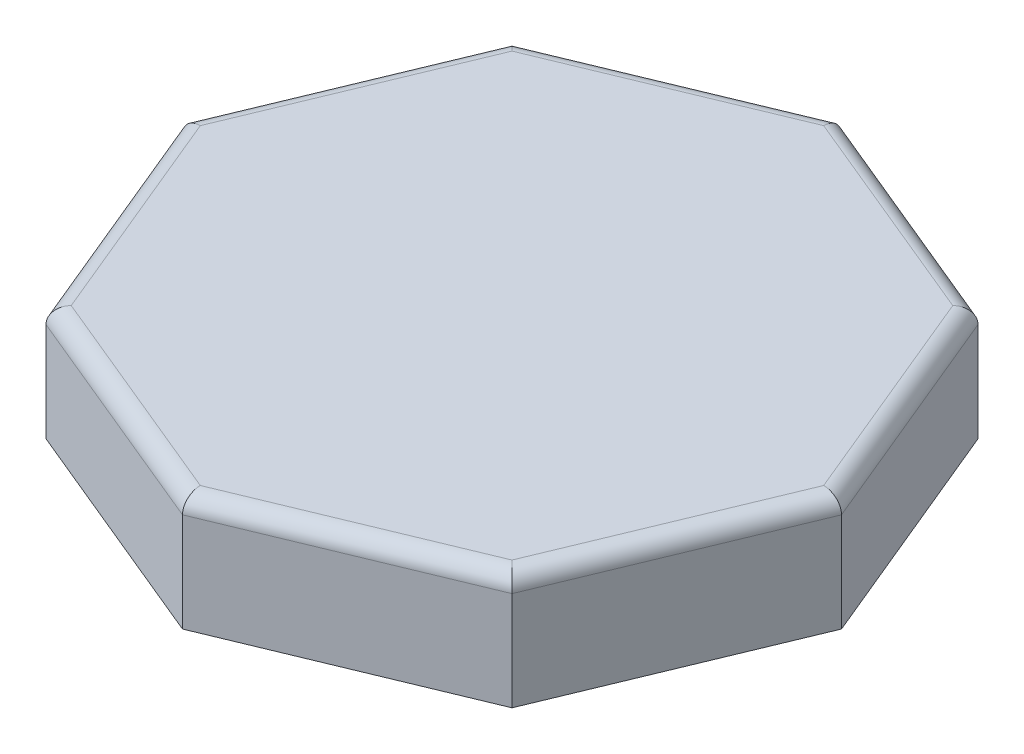
ISO-10303-21;
HEADER;
FILE_DESCRIPTION(('STEP AP214'),'2;1');
FILE_NAME('part.step','',(''),(''),'','','');
FILE_SCHEMA(('AUTOMOTIVE_DESIGN { 1 0 10303 214 1 1 1 1 }'));
ENDSEC;
DATA;
#1=APPLICATION_CONTEXT('core data for automotive mechanical design processes');
#2=APPLICATION_PROTOCOL_DEFINITION('international standard','automotive_design',2000,#1);
#3=PRODUCT_CONTEXT('',#1,'mechanical');
#4=PRODUCT('Part','Part','',(#3));
#5=PRODUCT_RELATED_PRODUCT_CATEGORY('part','',(#4));
#6=PRODUCT_DEFINITION_FORMATION('','',#4);
#7=PRODUCT_DEFINITION_CONTEXT('part definition',#1,'design');
#8=PRODUCT_DEFINITION('design','',#6,#7);
#9=PRODUCT_DEFINITION_SHAPE('','',#8);
#10=(LENGTH_UNIT() NAMED_UNIT(*) SI_UNIT(.MILLI.,.METRE.));
#11=(NAMED_UNIT(*) PLANE_ANGLE_UNIT() SI_UNIT($,.RADIAN.));
#12=(NAMED_UNIT(*) SI_UNIT($,.STERADIAN.) SOLID_ANGLE_UNIT());
#13=UNCERTAINTY_MEASURE_WITH_UNIT(LENGTH_MEASURE(1.E-05),#10,'distance_accuracy_value','');
#14=(GEOMETRIC_REPRESENTATION_CONTEXT(3) GLOBAL_UNCERTAINTY_ASSIGNED_CONTEXT((#13)) GLOBAL_UNIT_ASSIGNED_CONTEXT((#10,
#11,#12)) REPRESENTATION_CONTEXT('',''));
#15=CARTESIAN_POINT('',(0.,0.,0.));
#16=DIRECTION('',(0.,0.,1.));
#17=DIRECTION('',(1.,0.,0.));
#18=AXIS2_PLACEMENT_3D('',#15,#16,#17);
#19=CARTESIAN_POINT('',(0.,70.,199.904133626086));
#20=DIRECTION('',(-0.38268343236509,0.,-0.923879532511287));
#21=DIRECTION('',(-0.923879532511287,0.,0.38268343236509));
#22=AXIS2_PLACEMENT_3D('',#19,#20,#21);
#23=PLANE('',#22);
#24=DIRECTION('',(0.,-1.,0.));
#25=VECTOR('',#24,1.);
#26=CARTESIAN_POINT('',(141.353568474227,70.,141.353568474227));
#27=LINE('',#26,#25);
#28=CARTESIAN_POINT('',(141.353568474227,60.,141.353568474227));
#29=VERTEX_POINT('',#28);
#30=CARTESIAN_POINT('',(141.353568474227,0.,141.353568474227));
#31=VERTEX_POINT('',#30);
#32=EDGE_CURVE('E281',#29,#31,#27,.T.);
#33=ORIENTED_EDGE('',*,*,#32,.F.);
#34=DIRECTION('',(0.923879532511287,0.,-0.38268343236509));
#35=VECTOR('',#34,1.);
#36=CARTESIAN_POINT('',(0.,60.,199.904133626086));
#37=LINE('',#36,#35);
#38=CARTESIAN_POINT('',(0.,60.,199.904133626086));
#39=VERTEX_POINT('',#38);
#40=EDGE_CURVE('E303',#29,#39,#37,.F.);
#41=ORIENTED_EDGE('',*,*,#40,.T.);
#42=DIRECTION('',(0.,-1.,0.));
#43=VECTOR('',#42,1.);
#44=CARTESIAN_POINT('',(0.,70.,199.904133626086));
#45=LINE('',#44,#43);
#46=CARTESIAN_POINT('',(0.,0.,199.904133626086));
#47=VERTEX_POINT('',#46);
#48=EDGE_CURVE('E267',#39,#47,#45,.T.);
#49=ORIENTED_EDGE('',*,*,#48,.T.);
#50=DIRECTION('',(0.923879532511287,0.,-0.38268343236509));
#51=VECTOR('',#50,1.);
#52=CARTESIAN_POINT('',(0.,0.,199.904133626086));
#53=LINE('',#52,#51);
#54=EDGE_CURVE('E243',#47,#31,#53,.T.);
#55=ORIENTED_EDGE('',*,*,#54,.T.);
#56=EDGE_LOOP('',(#33,#41,#49,#55));
#57=FACE_BOUND('',#56,.T.);
#58=ADVANCED_FACE('F37',(#57),#23,.F.);
#59=CARTESIAN_POINT('',(141.353568474227,70.,141.353568474227));
#60=DIRECTION('',(-0.923879532511287,0.,-0.38268343236509));
#61=DIRECTION('',(-0.38268343236509,0.,0.923879532511287));
#62=AXIS2_PLACEMENT_3D('',#59,#60,#61);
#63=PLANE('',#62);
#64=DIRECTION('',(0.,-1.,0.));
#65=VECTOR('',#64,1.);
#66=CARTESIAN_POINT('',(199.904133626086,70.,0.));
#67=LINE('',#66,#65);
#68=CARTESIAN_POINT('',(199.904133626086,60.,0.));
#69=VERTEX_POINT('',#68);
#70=CARTESIAN_POINT('',(199.904133626086,0.,0.));
#71=VERTEX_POINT('',#70);
#72=EDGE_CURVE('E279',#69,#71,#67,.T.);
#73=ORIENTED_EDGE('',*,*,#72,.F.);
#74=DIRECTION('',(0.38268343236509,0.,-0.923879532511287));
#75=VECTOR('',#74,1.);
#76=CARTESIAN_POINT('',(141.353568474227,60.,141.353568474227));
#77=LINE('',#76,#75);
#78=EDGE_CURVE('E300',#69,#29,#77,.F.);
#79=ORIENTED_EDGE('',*,*,#78,.T.);
#80=ORIENTED_EDGE('',*,*,#32,.T.);
#81=DIRECTION('',(0.38268343236509,0.,-0.923879532511287));
#82=VECTOR('',#81,1.);
#83=CARTESIAN_POINT('',(141.353568474227,0.,141.353568474227));
#84=LINE('',#83,#82);
#85=EDGE_CURVE('E246',#31,#71,#84,.T.);
#86=ORIENTED_EDGE('',*,*,#85,.T.);
#87=EDGE_LOOP('',(#73,#79,#80,#86));
#88=FACE_BOUND('',#87,.T.);
#89=ADVANCED_FACE('F455',(#88),#63,.F.);
#90=CARTESIAN_POINT('',(199.904133626086,70.,0.));
#91=DIRECTION('',(-0.923879532511287,0.,0.38268343236509));
#92=DIRECTION('',(0.38268343236509,0.,0.923879532511287));
#93=AXIS2_PLACEMENT_3D('',#90,#91,#92);
#94=PLANE('',#93);
#95=DIRECTION('',(0.,-1.,0.));
#96=VECTOR('',#95,1.);
#97=CARTESIAN_POINT('',(141.353568474227,70.,-141.353568474227));
#98=LINE('',#97,#96);
#99=CARTESIAN_POINT('',(141.353568474227,60.,-141.353568474227));
#100=VERTEX_POINT('',#99);
#101=CARTESIAN_POINT('',(141.353568474227,0.,-141.353568474227));
#102=VERTEX_POINT('',#101);
#103=EDGE_CURVE('E277',#100,#102,#98,.T.);
#104=ORIENTED_EDGE('',*,*,#103,.F.);
#105=DIRECTION('',(-0.38268343236509,0.,-0.923879532511287));
#106=VECTOR('',#105,1.);
#107=CARTESIAN_POINT('',(199.904133626086,60.,0.));
#108=LINE('',#107,#106);
#109=EDGE_CURVE('E315',#100,#69,#108,.F.);
#110=ORIENTED_EDGE('',*,*,#109,.T.);
#111=ORIENTED_EDGE('',*,*,#72,.T.);
#112=DIRECTION('',(-0.38268343236509,0.,-0.923879532511287));
#113=VECTOR('',#112,1.);
#114=CARTESIAN_POINT('',(199.904133626086,0.,0.));
#115=LINE('',#114,#113);
#116=EDGE_CURVE('E249',#71,#102,#115,.T.);
#117=ORIENTED_EDGE('',*,*,#116,.T.);
#118=EDGE_LOOP('',(#104,#110,#111,#117));
#119=FACE_BOUND('',#118,.T.);
#120=ADVANCED_FACE('F461',(#119),#94,.F.);
#121=CARTESIAN_POINT('',(141.353568474227,70.,-141.353568474227));
#122=DIRECTION('',(-0.38268343236509,0.,0.923879532511287));
#123=DIRECTION('',(0.923879532511287,0.,0.38268343236509));
#124=AXIS2_PLACEMENT_3D('',#121,#122,#123);
#125=PLANE('',#124);
#126=DIRECTION('',(0.,-1.,0.));
#127=VECTOR('',#126,1.);
#128=CARTESIAN_POINT('',(0.,70.,-199.904133626086));
#129=LINE('',#128,#127);
#130=CARTESIAN_POINT('',(0.,60.,-199.904133626086));
#131=VERTEX_POINT('',#130);
#132=CARTESIAN_POINT('',(0.,0.,-199.904133626086));
#133=VERTEX_POINT('',#132);
#134=EDGE_CURVE('E275',#131,#133,#129,.T.);
#135=ORIENTED_EDGE('',*,*,#134,.F.);
#136=DIRECTION('',(-0.923879532511287,0.,-0.38268343236509));
#137=VECTOR('',#136,1.);
#138=CARTESIAN_POINT('',(141.353568474227,60.,-141.353568474227));
#139=LINE('',#138,#137);
#140=EDGE_CURVE('E313',#131,#100,#139,.F.);
#141=ORIENTED_EDGE('',*,*,#140,.T.);
#142=ORIENTED_EDGE('',*,*,#103,.T.);
#143=DIRECTION('',(-0.923879532511287,0.,-0.38268343236509));
#144=VECTOR('',#143,1.);
#145=CARTESIAN_POINT('',(141.353568474227,0.,-141.353568474227));
#146=LINE('',#145,#144);
#147=EDGE_CURVE('E252',#102,#133,#146,.T.);
#148=ORIENTED_EDGE('',*,*,#147,.T.);
#149=EDGE_LOOP('',(#135,#141,#142,#148));
#150=FACE_BOUND('',#149,.T.);
#151=ADVANCED_FACE('F515',(#150),#125,.F.);
#152=CARTESIAN_POINT('',(0.,70.,-199.904133626086));
#153=DIRECTION('',(0.38268343236509,0.,0.923879532511287));
#154=DIRECTION('',(0.923879532511287,0.,-0.38268343236509));
#155=AXIS2_PLACEMENT_3D('',#152,#153,#154);
#156=PLANE('',#155);
#157=DIRECTION('',(0.,-1.,0.));
#158=VECTOR('',#157,1.);
#159=CARTESIAN_POINT('',(-141.353568474227,70.,-141.353568474227));
#160=LINE('',#159,#158);
#161=CARTESIAN_POINT('',(-141.353568474227,60.,-141.353568474227));
#162=VERTEX_POINT('',#161);
#163=CARTESIAN_POINT('',(-141.353568474227,0.,-141.353568474227));
#164=VERTEX_POINT('',#163);
#165=EDGE_CURVE('E273',#162,#164,#160,.T.);
#166=ORIENTED_EDGE('',*,*,#165,.F.);
#167=DIRECTION('',(-0.923879532511287,0.,0.38268343236509));
#168=VECTOR('',#167,1.);
#169=CARTESIAN_POINT('',(0.,60.,-199.904133626086));
#170=LINE('',#169,#168);
#171=EDGE_CURVE('E311',#162,#131,#170,.F.);
#172=ORIENTED_EDGE('',*,*,#171,.T.);
#173=ORIENTED_EDGE('',*,*,#134,.T.);
#174=DIRECTION('',(-0.923879532511287,0.,0.38268343236509));
#175=VECTOR('',#174,1.);
#176=CARTESIAN_POINT('',(0.,0.,-199.904133626086));
#177=LINE('',#176,#175);
#178=EDGE_CURVE('E255',#133,#164,#177,.T.);
#179=ORIENTED_EDGE('',*,*,#178,.T.);
#180=EDGE_LOOP('',(#166,#172,#173,#179));
#181=FACE_BOUND('',#180,.T.);
#182=ADVANCED_FACE('F513',(#181),#156,.F.);
#183=CARTESIAN_POINT('',(-141.353568474227,70.,-141.353568474227));
#184=DIRECTION('',(0.923879532511287,0.,0.38268343236509));
#185=DIRECTION('',(0.38268343236509,0.,-0.923879532511287));
#186=AXIS2_PLACEMENT_3D('',#183,#184,#185);
#187=PLANE('',#186);
#188=DIRECTION('',(0.,-1.,0.));
#189=VECTOR('',#188,1.);
#190=CARTESIAN_POINT('',(-199.904133626086,70.,0.));
#191=LINE('',#190,#189);
#192=CARTESIAN_POINT('',(-199.904133626086,60.,0.));
#193=VERTEX_POINT('',#192);
#194=CARTESIAN_POINT('',(-199.904133626086,0.,0.));
#195=VERTEX_POINT('',#194);
#196=EDGE_CURVE('E271',#193,#195,#191,.T.);
#197=ORIENTED_EDGE('',*,*,#196,.F.);
#198=DIRECTION('',(-0.38268343236509,0.,0.923879532511287));
#199=VECTOR('',#198,1.);
#200=CARTESIAN_POINT('',(-141.353568474227,60.,-141.353568474227));
#201=LINE('',#200,#199);
#202=EDGE_CURVE('E309',#193,#162,#201,.F.);
#203=ORIENTED_EDGE('',*,*,#202,.T.);
#204=ORIENTED_EDGE('',*,*,#165,.T.);
#205=DIRECTION('',(-0.38268343236509,0.,0.923879532511287));
#206=VECTOR('',#205,1.);
#207=CARTESIAN_POINT('',(-141.353568474227,0.,-141.353568474227));
#208=LINE('',#207,#206);
#209=EDGE_CURVE('E258',#164,#195,#208,.T.);
#210=ORIENTED_EDGE('',*,*,#209,.T.);
#211=EDGE_LOOP('',(#197,#203,#204,#210));
#212=FACE_BOUND('',#211,.T.);
#213=ADVANCED_FACE('F526',(#212),#187,.F.);
#214=CARTESIAN_POINT('',(-199.904133626086,70.,0.));
#215=DIRECTION('',(0.923879532511287,0.,-0.38268343236509));
#216=DIRECTION('',(-0.38268343236509,0.,-0.923879532511287));
#217=AXIS2_PLACEMENT_3D('',#214,#215,#216);
#218=PLANE('',#217);
#219=DIRECTION('',(0.,-1.,0.));
#220=VECTOR('',#219,1.);
#221=CARTESIAN_POINT('',(-141.353568474227,70.,141.353568474227));
#222=LINE('',#221,#220);
#223=CARTESIAN_POINT('',(-141.353568474227,60.,141.353568474227));
#224=VERTEX_POINT('',#223);
#225=CARTESIAN_POINT('',(-141.353568474227,0.,141.353568474227));
#226=VERTEX_POINT('',#225);
#227=EDGE_CURVE('E269',#224,#226,#222,.T.);
#228=ORIENTED_EDGE('',*,*,#227,.F.);
#229=DIRECTION('',(0.38268343236509,0.,0.923879532511287));
#230=VECTOR('',#229,1.);
#231=CARTESIAN_POINT('',(-199.904133626086,60.,0.));
#232=LINE('',#231,#230);
#233=EDGE_CURVE('E307',#224,#193,#232,.F.);
#234=ORIENTED_EDGE('',*,*,#233,.T.);
#235=ORIENTED_EDGE('',*,*,#196,.T.);
#236=DIRECTION('',(0.38268343236509,0.,0.923879532511287));
#237=VECTOR('',#236,1.);
#238=CARTESIAN_POINT('',(-199.904133626086,0.,0.));
#239=LINE('',#238,#237);
#240=EDGE_CURVE('E261',#195,#226,#239,.T.);
#241=ORIENTED_EDGE('',*,*,#240,.T.);
#242=EDGE_LOOP('',(#228,#234,#235,#241));
#243=FACE_BOUND('',#242,.T.);
#244=ADVANCED_FACE('F529',(#243),#218,.F.);
#245=CARTESIAN_POINT('',(-141.353568474227,70.,141.353568474227));
#246=DIRECTION('',(0.38268343236509,0.,-0.923879532511287));
#247=DIRECTION('',(-0.923879532511287,0.,-0.38268343236509));
#248=AXIS2_PLACEMENT_3D('',#245,#246,#247);
#249=PLANE('',#248);
#250=ORIENTED_EDGE('',*,*,#48,.F.);
#251=DIRECTION('',(0.923879532511287,0.,0.38268343236509));
#252=VECTOR('',#251,1.);
#253=CARTESIAN_POINT('',(-141.353568474227,60.,141.353568474227));
#254=LINE('',#253,#252);
#255=EDGE_CURVE('E305',#39,#224,#254,.F.);
#256=ORIENTED_EDGE('',*,*,#255,.T.);
#257=ORIENTED_EDGE('',*,*,#227,.T.);
#258=DIRECTION('',(0.923879532511287,0.,0.38268343236509));
#259=VECTOR('',#258,1.);
#260=CARTESIAN_POINT('',(-141.353568474227,0.,141.353568474227));
#261=LINE('',#260,#259);
#262=EDGE_CURVE('E264',#226,#47,#261,.T.);
#263=ORIENTED_EDGE('',*,*,#262,.T.);
#264=EDGE_LOOP('',(#250,#256,#257,#263));
#265=FACE_BOUND('',#264,.T.);
#266=ADVANCED_FACE('F553',(#265),#249,.F.);
#267=CARTESIAN_POINT('',(0.,70.,0.));
#268=DIRECTION('',(0.,1.,0.));
#269=DIRECTION('',(0.,0.,1.));
#270=AXIS2_PLACEMENT_3D('',#267,#268,#269);
#271=PLANE('',#270);
#272=DIRECTION('',(0.923879532511287,0.,-0.38268343236509));
#273=VECTOR('',#272,1.);
#274=CARTESIAN_POINT('',(137.526734150576,70.,132.114773149114));
#275=LINE('',#274,#273);
#276=CARTESIAN_POINT('',(0.,70.,189.080211623162));
#277=VERTEX_POINT('',#276);
#278=CARTESIAN_POINT('',(133.699899826925,70.,133.699899826925));
#279=VERTEX_POINT('',#278);
#280=EDGE_CURVE('E295',#277,#279,#275,.T.);
#281=ORIENTED_EDGE('',*,*,#280,.T.);
#282=DIRECTION('',(0.38268343236509,0.,-0.923879532511287));
#283=VECTOR('',#282,1.);
#284=CARTESIAN_POINT('',(190.665338300973,70.,-3.826834323651));
#285=LINE('',#284,#283);
#286=CARTESIAN_POINT('',(189.080211623162,70.,0.));
#287=VERTEX_POINT('',#286);
#288=EDGE_CURVE('E297',#279,#287,#285,.T.);
#289=ORIENTED_EDGE('',*,*,#288,.T.);
#290=DIRECTION('',(-0.38268343236509,0.,-0.923879532511287));
#291=VECTOR('',#290,1.);
#292=CARTESIAN_POINT('',(132.114773149114,70.,-137.526734150576));
#293=LINE('',#292,#291);
#294=CARTESIAN_POINT('',(133.699899826925,70.,-133.699899826925));
#295=VERTEX_POINT('',#294);
#296=EDGE_CURVE('E283',#287,#295,#293,.T.);
#297=ORIENTED_EDGE('',*,*,#296,.T.);
#298=DIRECTION('',(-0.923879532511287,0.,-0.38268343236509));
#299=VECTOR('',#298,1.);
#300=CARTESIAN_POINT('',(-3.82683432365091,70.,-190.665338300973));
#301=LINE('',#300,#299);
#302=CARTESIAN_POINT('',(0.,70.,-189.080211623162));
#303=VERTEX_POINT('',#302);
#304=EDGE_CURVE('E285',#295,#303,#301,.T.);
#305=ORIENTED_EDGE('',*,*,#304,.T.);
#306=DIRECTION('',(-0.923879532511287,0.,0.38268343236509));
#307=VECTOR('',#306,1.);
#308=CARTESIAN_POINT('',(-137.526734150576,70.,-132.114773149114));
#309=LINE('',#308,#307);
#310=CARTESIAN_POINT('',(-133.699899826925,70.,-133.699899826925));
#311=VERTEX_POINT('',#310);
#312=EDGE_CURVE('E287',#303,#311,#309,.T.);
#313=ORIENTED_EDGE('',*,*,#312,.T.);
#314=DIRECTION('',(-0.38268343236509,0.,0.923879532511287));
#315=VECTOR('',#314,1.);
#316=CARTESIAN_POINT('',(-190.665338300973,70.,3.82683432365098));
#317=LINE('',#316,#315);
#318=CARTESIAN_POINT('',(-189.080211623162,70.,0.));
#319=VERTEX_POINT('',#318);
#320=EDGE_CURVE('E289',#311,#319,#317,.T.);
#321=ORIENTED_EDGE('',*,*,#320,.T.);
#322=DIRECTION('',(0.38268343236509,0.,0.923879532511287));
#323=VECTOR('',#322,1.);
#324=CARTESIAN_POINT('',(-132.114773149114,70.,137.526734150576));
#325=LINE('',#324,#323);
#326=CARTESIAN_POINT('',(-133.699899826925,70.,133.699899826925));
#327=VERTEX_POINT('',#326);
#328=EDGE_CURVE('E291',#319,#327,#325,.T.);
#329=ORIENTED_EDGE('',*,*,#328,.T.);
#330=DIRECTION('',(0.923879532511287,0.,0.38268343236509));
#331=VECTOR('',#330,1.);
#332=CARTESIAN_POINT('',(3.8268343236509,70.,190.665338300973));
#333=LINE('',#332,#331);
#334=EDGE_CURVE('E293',#327,#277,#333,.T.);
#335=ORIENTED_EDGE('',*,*,#334,.T.);
#336=EDGE_LOOP('',(#281,#289,#297,#305,#313,#321,#329,#335));
#337=FACE_BOUND('',#336,.T.);
#338=ADVANCED_FACE('F538',(#337),#271,.T.);
#339=CARTESIAN_POINT('',(0.,0.,0.));
#340=DIRECTION('',(0.,1.,0.));
#341=DIRECTION('',(0.,0.,1.));
#342=AXIS2_PLACEMENT_3D('',#339,#340,#341);
#343=PLANE('',#342);
#344=DIRECTION('',(0.923879532511287,0.,0.38268343236509));
#345=VECTOR('',#344,1.);
#346=CARTESIAN_POINT('',(-140.205518177132,0.,138.581929876693));
#347=LINE('',#346,#345);
#348=CARTESIAN_POINT('',(-139.057467880036,0.,139.057467880036));
#349=VERTEX_POINT('',#348);
#350=CARTESIAN_POINT('',(0.,0.,196.656957025208));
#351=VERTEX_POINT('',#350);
#352=EDGE_CURVE('E203',#349,#351,#347,.T.);
#353=ORIENTED_EDGE('',*,*,#352,.T.);
#354=DIRECTION('',(0.923879532511287,0.,-0.38268343236509));
#355=VECTOR('',#354,1.);
#356=CARTESIAN_POINT('',(-1.14805029709527,0.,197.132495028552));
#357=LINE('',#356,#355);
#358=CARTESIAN_POINT('',(139.057467880036,0.,139.057467880036));
#359=VERTEX_POINT('',#358);
#360=EDGE_CURVE('E212',#351,#359,#357,.T.);
#361=ORIENTED_EDGE('',*,*,#360,.T.);
#362=DIRECTION('',(0.38268343236509,0.,-0.923879532511287));
#363=VECTOR('',#362,1.);
#364=CARTESIAN_POINT('',(138.581929876693,0.,140.205518177132));
#365=LINE('',#364,#363);
#366=CARTESIAN_POINT('',(196.656957025208,0.,0.));
#367=VERTEX_POINT('',#366);
#368=EDGE_CURVE('E219',#359,#367,#365,.T.);
#369=ORIENTED_EDGE('',*,*,#368,.T.);
#370=DIRECTION('',(-0.38268343236509,0.,-0.923879532511287));
#371=VECTOR('',#370,1.);
#372=CARTESIAN_POINT('',(197.132495028552,0.,1.14805029709519));
#373=LINE('',#372,#371);
#374=CARTESIAN_POINT('',(139.057467880036,0.,-139.057467880036));
#375=VERTEX_POINT('',#374);
#376=EDGE_CURVE('E239',#367,#375,#373,.T.);
#377=ORIENTED_EDGE('',*,*,#376,.T.);
#378=DIRECTION('',(-0.923879532511287,0.,-0.38268343236509));
#379=VECTOR('',#378,1.);
#380=CARTESIAN_POINT('',(140.205518177132,0.,-138.581929876693));
#381=LINE('',#380,#379);
#382=CARTESIAN_POINT('',(0.,0.,-196.656957025208));
#383=VERTEX_POINT('',#382);
#384=EDGE_CURVE('E236',#375,#383,#381,.T.);
#385=ORIENTED_EDGE('',*,*,#384,.T.);
#386=DIRECTION('',(-0.923879532511287,0.,0.38268343236509));
#387=VECTOR('',#386,1.);
#388=CARTESIAN_POINT('',(1.14805029709527,0.,-197.132495028552));
#389=LINE('',#388,#387);
#390=CARTESIAN_POINT('',(-139.057467880036,0.,-139.057467880036));
#391=VERTEX_POINT('',#390);
#392=EDGE_CURVE('E233',#383,#391,#389,.T.);
#393=ORIENTED_EDGE('',*,*,#392,.T.);
#394=DIRECTION('',(-0.38268343236509,0.,0.923879532511287));
#395=VECTOR('',#394,1.);
#396=CARTESIAN_POINT('',(-138.581929876693,0.,-140.205518177132));
#397=LINE('',#396,#395);
#398=CARTESIAN_POINT('',(-196.656957025208,0.,0.));
#399=VERTEX_POINT('',#398);
#400=EDGE_CURVE('E228',#391,#399,#397,.T.);
#401=ORIENTED_EDGE('',*,*,#400,.T.);
#402=DIRECTION('',(0.38268343236509,0.,0.923879532511287));
#403=VECTOR('',#402,1.);
#404=CARTESIAN_POINT('',(-197.132495028552,0.,-1.14805029709521));
#405=LINE('',#404,#403);
#406=EDGE_CURVE('E226',#399,#349,#405,.T.);
#407=ORIENTED_EDGE('',*,*,#406,.T.);
#408=EDGE_LOOP('',(#353,#361,#369,#377,#385,#393,#401,#407));
#409=FACE_BOUND('',#408,.T.);
#410=ORIENTED_EDGE('',*,*,#54,.F.);
#411=ORIENTED_EDGE('',*,*,#262,.F.);
#412=ORIENTED_EDGE('',*,*,#240,.F.);
#413=ORIENTED_EDGE('',*,*,#209,.F.);
#414=ORIENTED_EDGE('',*,*,#178,.F.);
#415=ORIENTED_EDGE('',*,*,#147,.F.);
#416=ORIENTED_EDGE('',*,*,#116,.F.);
#417=ORIENTED_EDGE('',*,*,#85,.F.);
#418=EDGE_LOOP('',(#410,#411,#412,#413,#414,#415,#416,#417));
#419=FACE_BOUND('',#418,.T.);
#420=ADVANCED_FACE('F222',(#409,#419),#343,.F.);
#421=CARTESIAN_POINT('',(-1.14805029709527,70.,197.132495028552));
#422=DIRECTION('',(-0.38268343236509,0.,-0.923879532511287));
#423=DIRECTION('',(-0.923879532511287,0.,0.38268343236509));
#424=AXIS2_PLACEMENT_3D('',#421,#422,#423);
#425=PLANE('',#424);
#426=DIRECTION('',(0.,-1.,0.));
#427=VECTOR('',#426,1.);
#428=CARTESIAN_POINT('',(0.,70.,196.656957025208));
#429=LINE('',#428,#427);
#430=CARTESIAN_POINT('',(0.,64.,196.656957025208));
#431=VERTEX_POINT('',#430);
#432=EDGE_CURVE('E198',#431,#351,#429,.T.);
#433=ORIENTED_EDGE('',*,*,#432,.F.);
#434=DIRECTION('',(0.923879532511287,0.,-0.38268343236509));
#435=VECTOR('',#434,1.);
#436=CARTESIAN_POINT('',(-1.14805029709527,64.,197.132495028552));
#437=LINE('',#436,#435);
#438=CARTESIAN_POINT('',(139.057467880036,64.,139.057467880036));
#439=VERTEX_POINT('',#438);
#440=EDGE_CURVE('E360',#431,#439,#437,.T.);
#441=ORIENTED_EDGE('',*,*,#440,.T.);
#442=DIRECTION('',(0.,-1.,0.));
#443=VECTOR('',#442,1.);
#444=CARTESIAN_POINT('',(139.057467880036,70.,139.057467880036));
#445=LINE('',#444,#443);
#446=EDGE_CURVE('E215',#439,#359,#445,.T.);
#447=ORIENTED_EDGE('',*,*,#446,.T.);
#448=ORIENTED_EDGE('',*,*,#360,.F.);
#449=EDGE_LOOP('',(#433,#441,#447,#448));
#450=FACE_BOUND('',#449,.T.);
#451=ADVANCED_FACE('F213',(#450),#425,.T.);
#452=CARTESIAN_POINT('',(138.581929876693,70.,140.205518177132));
#453=DIRECTION('',(-0.923879532511287,0.,-0.38268343236509));
#454=DIRECTION('',(-0.38268343236509,0.,0.923879532511287));
#455=AXIS2_PLACEMENT_3D('',#452,#453,#454);
#456=PLANE('',#455);
#457=ORIENTED_EDGE('',*,*,#446,.F.);
#458=DIRECTION('',(0.38268343236509,0.,-0.923879532511287));
#459=VECTOR('',#458,1.);
#460=CARTESIAN_POINT('',(138.581929876693,64.,140.205518177132));
#461=LINE('',#460,#459);
#462=CARTESIAN_POINT('',(196.656957025208,64.,0.));
#463=VERTEX_POINT('',#462);
#464=EDGE_CURVE('E358',#439,#463,#461,.T.);
#465=ORIENTED_EDGE('',*,*,#464,.T.);
#466=DIRECTION('',(0.,-1.,0.));
#467=VECTOR('',#466,1.);
#468=CARTESIAN_POINT('',(196.656957025208,70.,0.));
#469=LINE('',#468,#467);
#470=EDGE_CURVE('E414',#463,#367,#469,.T.);
#471=ORIENTED_EDGE('',*,*,#470,.T.);
#472=ORIENTED_EDGE('',*,*,#368,.F.);
#473=EDGE_LOOP('',(#457,#465,#471,#472));
#474=FACE_BOUND('',#473,.T.);
#475=ADVANCED_FACE('F413',(#474),#456,.T.);
#476=CARTESIAN_POINT('',(197.132495028552,70.,1.14805029709519));
#477=DIRECTION('',(-0.923879532511287,0.,0.38268343236509));
#478=DIRECTION('',(0.38268343236509,0.,0.923879532511287));
#479=AXIS2_PLACEMENT_3D('',#476,#477,#478);
#480=PLANE('',#479);
#481=ORIENTED_EDGE('',*,*,#470,.F.);
#482=DIRECTION('',(-0.38268343236509,0.,-0.923879532511287));
#483=VECTOR('',#482,1.);
#484=CARTESIAN_POINT('',(197.132495028552,64.,1.14805029709519));
#485=LINE('',#484,#483);
#486=CARTESIAN_POINT('',(139.057467880036,64.,-139.057467880036));
#487=VERTEX_POINT('',#486);
#488=EDGE_CURVE('E317',#463,#487,#485,.T.);
#489=ORIENTED_EDGE('',*,*,#488,.T.);
#490=DIRECTION('',(0.,-1.,0.));
#491=VECTOR('',#490,1.);
#492=CARTESIAN_POINT('',(139.057467880036,70.,-139.057467880036));
#493=LINE('',#492,#491);
#494=EDGE_CURVE('E418',#487,#375,#493,.T.);
#495=ORIENTED_EDGE('',*,*,#494,.T.);
#496=ORIENTED_EDGE('',*,*,#376,.F.);
#497=EDGE_LOOP('',(#481,#489,#495,#496));
#498=FACE_BOUND('',#497,.T.);
#499=ADVANCED_FACE('F417',(#498),#480,.T.);
#500=CARTESIAN_POINT('',(140.205518177132,70.,-138.581929876693));
#501=DIRECTION('',(-0.38268343236509,0.,0.923879532511287));
#502=DIRECTION('',(0.923879532511287,0.,0.38268343236509));
#503=AXIS2_PLACEMENT_3D('',#500,#501,#502);
#504=PLANE('',#503);
#505=ORIENTED_EDGE('',*,*,#494,.F.);
#506=DIRECTION('',(-0.923879532511287,0.,-0.38268343236509));
#507=VECTOR('',#506,1.);
#508=CARTESIAN_POINT('',(140.205518177132,64.,-138.581929876693));
#509=LINE('',#508,#507);
#510=CARTESIAN_POINT('',(0.,64.,-196.656957025208));
#511=VERTEX_POINT('',#510);
#512=EDGE_CURVE('E11',#487,#511,#509,.T.);
#513=ORIENTED_EDGE('',*,*,#512,.T.);
#514=DIRECTION('',(0.,-1.,0.));
#515=VECTOR('',#514,1.);
#516=CARTESIAN_POINT('',(0.,70.,-196.656957025208));
#517=LINE('',#516,#515);
#518=EDGE_CURVE('E421',#511,#383,#517,.T.);
#519=ORIENTED_EDGE('',*,*,#518,.T.);
#520=ORIENTED_EDGE('',*,*,#384,.F.);
#521=EDGE_LOOP('',(#505,#513,#519,#520));
#522=FACE_BOUND('',#521,.T.);
#523=ADVANCED_FACE('F676',(#522),#504,.T.);
#524=CARTESIAN_POINT('',(1.14805029709527,70.,-197.132495028552));
#525=DIRECTION('',(0.38268343236509,0.,0.923879532511287));
#526=DIRECTION('',(0.923879532511287,0.,-0.38268343236509));
#527=AXIS2_PLACEMENT_3D('',#524,#525,#526);
#528=PLANE('',#527);
#529=ORIENTED_EDGE('',*,*,#518,.F.);
#530=DIRECTION('',(-0.923879532511287,0.,0.38268343236509));
#531=VECTOR('',#530,1.);
#532=CARTESIAN_POINT('',(1.14805029709527,64.,-197.132495028552));
#533=LINE('',#532,#531);
#534=CARTESIAN_POINT('',(-139.057467880036,64.,-139.057467880036));
#535=VERTEX_POINT('',#534);
#536=EDGE_CURVE('E46',#511,#535,#533,.T.);
#537=ORIENTED_EDGE('',*,*,#536,.T.);
#538=DIRECTION('',(0.,-1.,0.));
#539=VECTOR('',#538,1.);
#540=CARTESIAN_POINT('',(-139.057467880036,70.,-139.057467880036));
#541=LINE('',#540,#539);
#542=EDGE_CURVE('E425',#535,#391,#541,.T.);
#543=ORIENTED_EDGE('',*,*,#542,.T.);
#544=ORIENTED_EDGE('',*,*,#392,.F.);
#545=EDGE_LOOP('',(#529,#537,#543,#544));
#546=FACE_BOUND('',#545,.T.);
#547=ADVANCED_FACE('F685',(#546),#528,.T.);
#548=CARTESIAN_POINT('',(-138.581929876693,70.,-140.205518177132));
#549=DIRECTION('',(0.923879532511287,0.,0.38268343236509));
#550=DIRECTION('',(0.38268343236509,0.,-0.923879532511287));
#551=AXIS2_PLACEMENT_3D('',#548,#549,#550);
#552=PLANE('',#551);
#553=ORIENTED_EDGE('',*,*,#542,.F.);
#554=DIRECTION('',(-0.38268343236509,0.,0.923879532511287));
#555=VECTOR('',#554,1.);
#556=CARTESIAN_POINT('',(-138.581929876693,64.,-140.205518177132));
#557=LINE('',#556,#555);
#558=CARTESIAN_POINT('',(-196.656957025208,64.,0.));
#559=VERTEX_POINT('',#558);
#560=EDGE_CURVE('E365',#535,#559,#557,.T.);
#561=ORIENTED_EDGE('',*,*,#560,.T.);
#562=DIRECTION('',(0.,-1.,0.));
#563=VECTOR('',#562,1.);
#564=CARTESIAN_POINT('',(-196.656957025208,70.,0.));
#565=LINE('',#564,#563);
#566=EDGE_CURVE('E427',#559,#399,#565,.T.);
#567=ORIENTED_EDGE('',*,*,#566,.T.);
#568=ORIENTED_EDGE('',*,*,#400,.F.);
#569=EDGE_LOOP('',(#553,#561,#567,#568));
#570=FACE_BOUND('',#569,.T.);
#571=ADVANCED_FACE('F433',(#570),#552,.T.);
#572=CARTESIAN_POINT('',(-197.132495028552,70.,-1.14805029709521));
#573=DIRECTION('',(0.923879532511287,0.,-0.38268343236509));
#574=DIRECTION('',(-0.38268343236509,0.,-0.923879532511287));
#575=AXIS2_PLACEMENT_3D('',#572,#573,#574);
#576=PLANE('',#575);
#577=ORIENTED_EDGE('',*,*,#566,.F.);
#578=DIRECTION('',(0.38268343236509,0.,0.923879532511287));
#579=VECTOR('',#578,1.);
#580=CARTESIAN_POINT('',(-197.132495028552,64.,-1.14805029709521));
#581=LINE('',#580,#579);
#582=CARTESIAN_POINT('',(-139.057467880036,64.,139.057467880036));
#583=VERTEX_POINT('',#582);
#584=EDGE_CURVE('E363',#559,#583,#581,.T.);
#585=ORIENTED_EDGE('',*,*,#584,.T.);
#586=DIRECTION('',(0.,-1.,0.));
#587=VECTOR('',#586,1.);
#588=CARTESIAN_POINT('',(-139.057467880036,70.,139.057467880036));
#589=LINE('',#588,#587);
#590=EDGE_CURVE('E209',#583,#349,#589,.T.);
#591=ORIENTED_EDGE('',*,*,#590,.T.);
#592=ORIENTED_EDGE('',*,*,#406,.F.);
#593=EDGE_LOOP('',(#577,#585,#591,#592));
#594=FACE_BOUND('',#593,.T.);
#595=ADVANCED_FACE('F430',(#594),#576,.T.);
#596=CARTESIAN_POINT('',(-140.205518177132,70.,138.581929876693));
#597=DIRECTION('',(0.38268343236509,0.,-0.923879532511287));
#598=DIRECTION('',(-0.923879532511287,0.,-0.38268343236509));
#599=AXIS2_PLACEMENT_3D('',#596,#597,#598);
#600=PLANE('',#599);
#601=ORIENTED_EDGE('',*,*,#590,.F.);
#602=DIRECTION('',(0.923879532511287,0.,0.38268343236509));
#603=VECTOR('',#602,1.);
#604=CARTESIAN_POINT('',(-140.205518177132,64.,138.581929876693));
#605=LINE('',#604,#603);
#606=EDGE_CURVE('E206',#583,#431,#605,.T.);
#607=ORIENTED_EDGE('',*,*,#606,.T.);
#608=ORIENTED_EDGE('',*,*,#432,.T.);
#609=ORIENTED_EDGE('',*,*,#352,.F.);
#610=EDGE_LOOP('',(#601,#607,#608,#609));
#611=FACE_BOUND('',#610,.T.);
#612=ADVANCED_FACE('F201',(#611),#600,.T.);
#613=CARTESIAN_POINT('',(0.,67.,0.));
#614=DIRECTION('',(0.,1.,0.));
#615=DIRECTION('',(0.,0.,1.));
#616=AXIS2_PLACEMENT_3D('',#613,#614,#615);
#617=PLANE('',#616);
#618=DIRECTION('',(-0.923879532511287,0.,-0.38268343236509));
#619=VECTOR('',#618,1.);
#620=CARTESIAN_POINT('',(68.3806836429229,67.,-165.085573855089));
#621=LINE('',#620,#619);
#622=CARTESIAN_POINT('',(0.,67.,-193.409780424331));
#623=VERTEX_POINT('',#622);
#624=CARTESIAN_POINT('',(136.761367285846,67.,-136.761367285846));
#625=VERTEX_POINT('',#624);
#626=EDGE_CURVE('E341',#623,#625,#621,.F.);
#627=ORIENTED_EDGE('',*,*,#626,.T.);
#628=DIRECTION('',(-0.38268343236509,0.,-0.923879532511287));
#629=VECTOR('',#628,1.);
#630=CARTESIAN_POINT('',(165.085573855089,67.,-68.380683642923));
#631=LINE('',#630,#629);
#632=CARTESIAN_POINT('',(193.409780424331,67.,0.));
#633=VERTEX_POINT('',#632);
#634=EDGE_CURVE('E355',#625,#633,#631,.F.);
#635=ORIENTED_EDGE('',*,*,#634,.T.);
#636=DIRECTION('',(0.38268343236509,0.,-0.923879532511287));
#637=VECTOR('',#636,1.);
#638=CARTESIAN_POINT('',(165.085573855089,67.,68.3806836429229));
#639=LINE('',#638,#637);
#640=CARTESIAN_POINT('',(136.761367285846,67.,136.761367285846));
#641=VERTEX_POINT('',#640);
#642=EDGE_CURVE('E353',#633,#641,#639,.F.);
#643=ORIENTED_EDGE('',*,*,#642,.T.);
#644=DIRECTION('',(0.923879532511287,0.,-0.38268343236509));
#645=VECTOR('',#644,1.);
#646=CARTESIAN_POINT('',(68.3806836429229,67.,165.085573855089));
#647=LINE('',#646,#645);
#648=CARTESIAN_POINT('',(0.,67.,193.409780424331));
#649=VERTEX_POINT('',#648);
#650=EDGE_CURVE('E351',#641,#649,#647,.F.);
#651=ORIENTED_EDGE('',*,*,#650,.T.);
#652=DIRECTION('',(0.923879532511287,0.,0.38268343236509));
#653=VECTOR('',#652,1.);
#654=CARTESIAN_POINT('',(-68.3806836429229,67.,165.085573855089));
#655=LINE('',#654,#653);
#656=CARTESIAN_POINT('',(-136.761367285846,67.,136.761367285846));
#657=VERTEX_POINT('',#656);
#658=EDGE_CURVE('E349',#649,#657,#655,.F.);
#659=ORIENTED_EDGE('',*,*,#658,.T.);
#660=DIRECTION('',(0.38268343236509,0.,0.923879532511287));
#661=VECTOR('',#660,1.);
#662=CARTESIAN_POINT('',(-165.085573855089,67.,68.380683642923));
#663=LINE('',#662,#661);
#664=CARTESIAN_POINT('',(-193.409780424331,67.,0.));
#665=VERTEX_POINT('',#664);
#666=EDGE_CURVE('E347',#657,#665,#663,.F.);
#667=ORIENTED_EDGE('',*,*,#666,.T.);
#668=DIRECTION('',(-0.38268343236509,0.,0.923879532511287));
#669=VECTOR('',#668,1.);
#670=CARTESIAN_POINT('',(-165.085573855089,67.,-68.3806836429229));
#671=LINE('',#670,#669);
#672=CARTESIAN_POINT('',(-136.761367285846,67.,-136.761367285846));
#673=VERTEX_POINT('',#672);
#674=EDGE_CURVE('E345',#665,#673,#671,.F.);
#675=ORIENTED_EDGE('',*,*,#674,.T.);
#676=DIRECTION('',(-0.923879532511287,0.,0.38268343236509));
#677=VECTOR('',#676,1.);
#678=CARTESIAN_POINT('',(-68.3806836429229,67.,-165.085573855089));
#679=LINE('',#678,#677);
#680=EDGE_CURVE('E343',#673,#623,#679,.F.);
#681=ORIENTED_EDGE('',*,*,#680,.T.);
#682=EDGE_LOOP('',(#627,#635,#643,#651,#659,#667,#675,#681));
#683=FACE_BOUND('',#682,.T.);
#684=ADVANCED_FACE('F398',(#683),#617,.F.);
#685=CARTESIAN_POINT('',(-161.390055725043,60.,-66.8499499134626));
#686=DIRECTION('',(0.38268343236509,0.,-0.923879532511287));
#687=DIRECTION('',(-0.923879532511287,0.,-0.38268343236509));
#688=AXIS2_PLACEMENT_3D('',#685,#686,#687);
#689=CYLINDRICAL_SURFACE('',#688,10.);
#690=CARTESIAN_POINT('',(-133.699899826925,60.,-133.699899826925));
#691=DIRECTION('',(0.707106781186547,0.,-0.707106781186548));
#692=DIRECTION('',(0.707106781186547,0.,0.707106781186547));
#693=AXIS2_PLACEMENT_3D('',#690,#691,#692);
#694=ELLIPSE('',#693,10.8239220029239,10.);
#695=EDGE_CURVE('E334',#162,#311,#694,.T.);
#696=ORIENTED_EDGE('',*,*,#695,.F.);
#697=ORIENTED_EDGE('',*,*,#202,.F.);
#698=CARTESIAN_POINT('',(-189.080211623162,60.,0.));
#699=DIRECTION('',(0.,0.,-1.));
#700=DIRECTION('',(1.,0.,0.));
#701=AXIS2_PLACEMENT_3D('',#698,#699,#700);
#702=ELLIPSE('',#701,10.8239220029239,10.);
#703=EDGE_CURVE('E220',#319,#193,#702,.F.);
#704=ORIENTED_EDGE('',*,*,#703,.F.);
#705=ORIENTED_EDGE('',*,*,#320,.F.);
#706=EDGE_LOOP('',(#696,#697,#704,#705));
#707=FACE_BOUND('',#706,.T.);
#708=ADVANCED_FACE('F494',(#707),#689,.T.);
#709=CARTESIAN_POINT('',(-161.390055725043,60.,66.8499499134626));
#710=DIRECTION('',(-0.38268343236509,0.,-0.923879532511287));
#711=DIRECTION('',(-0.923879532511287,0.,0.38268343236509));
#712=AXIS2_PLACEMENT_3D('',#709,#710,#711);
#713=CYLINDRICAL_SURFACE('',#712,10.);
#714=ORIENTED_EDGE('',*,*,#703,.T.);
#715=ORIENTED_EDGE('',*,*,#233,.F.);
#716=CARTESIAN_POINT('',(-133.699899826925,60.,133.699899826925));
#717=DIRECTION('',(-0.707106781186548,0.,-0.707106781186548));
#718=DIRECTION('',(0.707106781186547,0.,-0.707106781186548));
#719=AXIS2_PLACEMENT_3D('',#716,#717,#718);
#720=ELLIPSE('',#719,10.8239220029239,10.);
#721=EDGE_CURVE('E331',#327,#224,#720,.F.);
#722=ORIENTED_EDGE('',*,*,#721,.F.);
#723=ORIENTED_EDGE('',*,*,#328,.F.);
#724=EDGE_LOOP('',(#714,#715,#722,#723));
#725=FACE_BOUND('',#724,.T.);
#726=ADVANCED_FACE('F490',(#725),#713,.T.);
#727=CARTESIAN_POINT('',(-66.8499499134626,60.,-161.390055725043));
#728=DIRECTION('',(0.923879532511287,0.,-0.38268343236509));
#729=DIRECTION('',(-0.38268343236509,0.,-0.923879532511287));
#730=AXIS2_PLACEMENT_3D('',#727,#728,#729);
#731=CYLINDRICAL_SURFACE('',#730,10.);
#732=ORIENTED_EDGE('',*,*,#695,.T.);
#733=ORIENTED_EDGE('',*,*,#312,.F.);
#734=CARTESIAN_POINT('',(0.,60.,-189.080211623162));
#735=DIRECTION('',(1.,0.,0.));
#736=DIRECTION('',(0.,0.,1.));
#737=AXIS2_PLACEMENT_3D('',#734,#735,#736);
#738=ELLIPSE('',#737,10.8239220029239,10.);
#739=EDGE_CURVE('E328',#131,#303,#738,.T.);
#740=ORIENTED_EDGE('',*,*,#739,.F.);
#741=ORIENTED_EDGE('',*,*,#171,.F.);
#742=EDGE_LOOP('',(#732,#733,#740,#741));
#743=FACE_BOUND('',#742,.T.);
#744=ADVANCED_FACE('F486',(#743),#731,.T.);
#745=CARTESIAN_POINT('',(-66.8499499134626,60.,161.390055725043));
#746=DIRECTION('',(-0.923879532511287,0.,-0.38268343236509));
#747=DIRECTION('',(-0.38268343236509,0.,0.923879532511287));
#748=AXIS2_PLACEMENT_3D('',#745,#746,#747);
#749=CYLINDRICAL_SURFACE('',#748,10.);
#750=ORIENTED_EDGE('',*,*,#721,.T.);
#751=ORIENTED_EDGE('',*,*,#255,.F.);
#752=CARTESIAN_POINT('',(0.,60.,189.080211623162));
#753=DIRECTION('',(-1.,0.,0.));
#754=DIRECTION('',(0.,0.,-1.));
#755=AXIS2_PLACEMENT_3D('',#752,#753,#754);
#756=ELLIPSE('',#755,10.8239220029239,10.);
#757=EDGE_CURVE('E325',#277,#39,#756,.F.);
#758=ORIENTED_EDGE('',*,*,#757,.F.);
#759=ORIENTED_EDGE('',*,*,#334,.F.);
#760=EDGE_LOOP('',(#750,#751,#758,#759));
#761=FACE_BOUND('',#760,.T.);
#762=ADVANCED_FACE('F482',(#761),#749,.T.);
#763=CARTESIAN_POINT('',(66.8499499134626,60.,-161.390055725043));
#764=DIRECTION('',(0.923879532511287,0.,0.38268343236509));
#765=DIRECTION('',(0.38268343236509,0.,-0.923879532511287));
#766=AXIS2_PLACEMENT_3D('',#763,#764,#765);
#767=CYLINDRICAL_SURFACE('',#766,10.);
#768=ORIENTED_EDGE('',*,*,#739,.T.);
#769=ORIENTED_EDGE('',*,*,#304,.F.);
#770=CARTESIAN_POINT('',(133.699899826925,60.,-133.699899826925));
#771=DIRECTION('',(0.707106781186548,0.,0.707106781186547));
#772=DIRECTION('',(-0.707106781186547,0.,0.707106781186548));
#773=AXIS2_PLACEMENT_3D('',#770,#771,#772);
#774=ELLIPSE('',#773,10.8239220029239,10.);
#775=EDGE_CURVE('E322',#100,#295,#774,.T.);
#776=ORIENTED_EDGE('',*,*,#775,.F.);
#777=ORIENTED_EDGE('',*,*,#140,.F.);
#778=EDGE_LOOP('',(#768,#769,#776,#777));
#779=FACE_BOUND('',#778,.T.);
#780=ADVANCED_FACE('F478',(#779),#767,.T.);
#781=CARTESIAN_POINT('',(66.8499499134626,60.,161.390055725043));
#782=DIRECTION('',(-0.923879532511287,0.,0.38268343236509));
#783=DIRECTION('',(0.38268343236509,0.,0.923879532511287));
#784=AXIS2_PLACEMENT_3D('',#781,#782,#783);
#785=CYLINDRICAL_SURFACE('',#784,10.);
#786=ORIENTED_EDGE('',*,*,#757,.T.);
#787=ORIENTED_EDGE('',*,*,#40,.F.);
#788=CARTESIAN_POINT('',(133.699899826925,60.,133.699899826925));
#789=DIRECTION('',(-0.707106781186547,0.,0.707106781186547));
#790=DIRECTION('',(-0.707106781186547,0.,-0.707106781186547));
#791=AXIS2_PLACEMENT_3D('',#788,#789,#790);
#792=ELLIPSE('',#791,10.8239220029239,10.);
#793=EDGE_CURVE('E320',#279,#29,#792,.F.);
#794=ORIENTED_EDGE('',*,*,#793,.F.);
#795=ORIENTED_EDGE('',*,*,#280,.F.);
#796=EDGE_LOOP('',(#786,#787,#794,#795));
#797=FACE_BOUND('',#796,.T.);
#798=ADVANCED_FACE('F474',(#797),#785,.T.);
#799=CARTESIAN_POINT('',(161.390055725043,60.,-66.8499499134626));
#800=DIRECTION('',(0.38268343236509,0.,0.923879532511287));
#801=DIRECTION('',(0.923879532511287,0.,-0.38268343236509));
#802=AXIS2_PLACEMENT_3D('',#799,#800,#801);
#803=CYLINDRICAL_SURFACE('',#802,10.);
#804=ORIENTED_EDGE('',*,*,#775,.T.);
#805=ORIENTED_EDGE('',*,*,#296,.F.);
#806=CARTESIAN_POINT('',(189.080211623162,60.,-1.45716771982052E-13));
#807=DIRECTION('',(0.,0.,1.));
#808=DIRECTION('',(1.,0.,0.));
#809=AXIS2_PLACEMENT_3D('',#806,#807,#808);
#810=ELLIPSE('',#809,10.8239220029239,10.);
#811=EDGE_CURVE('E318',#69,#287,#810,.T.);
#812=ORIENTED_EDGE('',*,*,#811,.F.);
#813=ORIENTED_EDGE('',*,*,#109,.F.);
#814=EDGE_LOOP('',(#804,#805,#812,#813));
#815=FACE_BOUND('',#814,.T.);
#816=ADVANCED_FACE('F470',(#815),#803,.T.);
#817=CARTESIAN_POINT('',(161.390055725043,60.,66.8499499134625));
#818=DIRECTION('',(-0.38268343236509,0.,0.923879532511287));
#819=DIRECTION('',(0.923879532511287,0.,0.38268343236509));
#820=AXIS2_PLACEMENT_3D('',#817,#818,#819);
#821=CYLINDRICAL_SURFACE('',#820,10.);
#822=ORIENTED_EDGE('',*,*,#793,.T.);
#823=ORIENTED_EDGE('',*,*,#78,.F.);
#824=ORIENTED_EDGE('',*,*,#811,.T.);
#825=ORIENTED_EDGE('',*,*,#288,.F.);
#826=EDGE_LOOP('',(#822,#823,#824,#825));
#827=FACE_BOUND('',#826,.T.);
#828=ADVANCED_FACE('F467',(#827),#821,.T.);
#829=CARTESIAN_POINT('',(-194.360856431018,64.,-2.29610059419048));
#830=DIRECTION('',(0.38268343236509,0.,0.923879532511287));
#831=DIRECTION('',(0.923879532511287,0.,-0.38268343236509));
#832=AXIS2_PLACEMENT_3D('',#829,#830,#831);
#833=CYLINDRICAL_SURFACE('',#832,3.);
#834=CARTESIAN_POINT('',(-193.409780424331,64.,1.47451495458029E-13));
#835=DIRECTION('',(0.,0.,1.));
#836=DIRECTION('',(1.,0.,0.));
#837=AXIS2_PLACEMENT_3D('',#834,#835,#836);
#838=ELLIPSE('',#837,3.24717660087718,3.);
#839=EDGE_CURVE('E383',#665,#559,#838,.T.);
#840=ORIENTED_EDGE('',*,*,#839,.F.);
#841=ORIENTED_EDGE('',*,*,#666,.F.);
#842=CARTESIAN_POINT('',(-136.761367285846,64.,136.761367285846));
#843=DIRECTION('',(0.707106781186548,0.,0.707106781186548));
#844=DIRECTION('',(0.707106781186547,0.,-0.707106781186548));
#845=AXIS2_PLACEMENT_3D('',#842,#843,#844);
#846=ELLIPSE('',#845,3.24717660087718,3.);
#847=EDGE_CURVE('E41',#583,#657,#846,.F.);
#848=ORIENTED_EDGE('',*,*,#847,.F.);
#849=ORIENTED_EDGE('',*,*,#584,.F.);
#850=EDGE_LOOP('',(#840,#841,#848,#849));
#851=FACE_BOUND('',#850,.T.);
#852=ADVANCED_FACE('F39',(#851),#833,.F.);
#853=CARTESIAN_POINT('',(-139.057467880036,64.,135.810291279159));
#854=DIRECTION('',(0.923879532511287,0.,0.38268343236509));
#855=DIRECTION('',(0.38268343236509,0.,-0.923879532511287));
#856=AXIS2_PLACEMENT_3D('',#853,#854,#855);
#857=CYLINDRICAL_SURFACE('',#856,3.);
#858=ORIENTED_EDGE('',*,*,#847,.T.);
#859=ORIENTED_EDGE('',*,*,#658,.F.);
#860=CARTESIAN_POINT('',(0.,64.,193.409780424331));
#861=DIRECTION('',(1.,0.,0.));
#862=DIRECTION('',(0.,0.,-1.));
#863=AXIS2_PLACEMENT_3D('',#860,#861,#862);
#864=ELLIPSE('',#863,3.24717660087718,3.);
#865=EDGE_CURVE('E381',#431,#649,#864,.F.);
#866=ORIENTED_EDGE('',*,*,#865,.F.);
#867=ORIENTED_EDGE('',*,*,#606,.F.);
#868=EDGE_LOOP('',(#858,#859,#866,#867));
#869=FACE_BOUND('',#868,.T.);
#870=ADVANCED_FACE('F393',(#869),#857,.F.);
#871=CARTESIAN_POINT('',(-135.810291279159,64.,-139.057467880036));
#872=DIRECTION('',(-0.38268343236509,0.,0.923879532511287));
#873=DIRECTION('',(0.923879532511287,0.,0.38268343236509));
#874=AXIS2_PLACEMENT_3D('',#871,#872,#873);
#875=CYLINDRICAL_SURFACE('',#874,3.);
#876=ORIENTED_EDGE('',*,*,#839,.T.);
#877=ORIENTED_EDGE('',*,*,#560,.F.);
#878=CARTESIAN_POINT('',(-136.761367285846,64.,-136.761367285846));
#879=DIRECTION('',(-0.707106781186547,0.,0.707106781186548));
#880=DIRECTION('',(0.707106781186547,0.,0.707106781186547));
#881=AXIS2_PLACEMENT_3D('',#878,#879,#880);
#882=ELLIPSE('',#881,3.24717660087718,3.);
#883=EDGE_CURVE('E378',#673,#535,#882,.T.);
#884=ORIENTED_EDGE('',*,*,#883,.F.);
#885=ORIENTED_EDGE('',*,*,#674,.F.);
#886=EDGE_LOOP('',(#876,#877,#884,#885));
#887=FACE_BOUND('',#886,.T.);
#888=ADVANCED_FACE('F434',(#887),#875,.F.);
#889=CARTESIAN_POINT('',(-2.29610059419054,64.,194.360856431018));
#890=DIRECTION('',(0.923879532511287,0.,-0.38268343236509));
#891=DIRECTION('',(-0.38268343236509,0.,-0.923879532511287));
#892=AXIS2_PLACEMENT_3D('',#889,#890,#891);
#893=CYLINDRICAL_SURFACE('',#892,3.);
#894=ORIENTED_EDGE('',*,*,#865,.T.);
#895=ORIENTED_EDGE('',*,*,#650,.F.);
#896=CARTESIAN_POINT('',(136.761367285846,64.,136.761367285846));
#897=DIRECTION('',(0.707106781186547,0.,-0.707106781186547));
#898=DIRECTION('',(-0.707106781186547,0.,-0.707106781186547));
#899=AXIS2_PLACEMENT_3D('',#896,#897,#898);
#900=ELLIPSE('',#899,3.24717660087718,3.);
#901=EDGE_CURVE('E375',#439,#641,#900,.F.);
#902=ORIENTED_EDGE('',*,*,#901,.F.);
#903=ORIENTED_EDGE('',*,*,#440,.F.);
#904=EDGE_LOOP('',(#894,#895,#902,#903));
#905=FACE_BOUND('',#904,.T.);
#906=ADVANCED_FACE('F404',(#905),#893,.F.);
#907=CARTESIAN_POINT('',(2.29610059419054,64.,-194.360856431018));
#908=DIRECTION('',(-0.923879532511287,0.,0.38268343236509));
#909=DIRECTION('',(0.38268343236509,0.,0.923879532511287));
#910=AXIS2_PLACEMENT_3D('',#907,#908,#909);
#911=CYLINDRICAL_SURFACE('',#910,3.);
#912=ORIENTED_EDGE('',*,*,#883,.T.);
#913=ORIENTED_EDGE('',*,*,#536,.F.);
#914=CARTESIAN_POINT('',(0.,64.,-193.409780424331));
#915=DIRECTION('',(-1.,0.,0.));
#916=DIRECTION('',(0.,0.,1.));
#917=AXIS2_PLACEMENT_3D('',#914,#915,#916);
#918=ELLIPSE('',#917,3.24717660087718,3.);
#919=EDGE_CURVE('E372',#623,#511,#918,.T.);
#920=ORIENTED_EDGE('',*,*,#919,.F.);
#921=ORIENTED_EDGE('',*,*,#680,.F.);
#922=EDGE_LOOP('',(#912,#913,#920,#921));
#923=FACE_BOUND('',#922,.T.);
#924=ADVANCED_FACE('F437',(#923),#911,.F.);
#925=CARTESIAN_POINT('',(135.810291279159,64.,139.057467880036));
#926=DIRECTION('',(0.38268343236509,0.,-0.923879532511287));
#927=DIRECTION('',(-0.923879532511287,0.,-0.38268343236509));
#928=AXIS2_PLACEMENT_3D('',#925,#926,#927);
#929=CYLINDRICAL_SURFACE('',#928,3.);
#930=ORIENTED_EDGE('',*,*,#901,.T.);
#931=ORIENTED_EDGE('',*,*,#642,.F.);
#932=CARTESIAN_POINT('',(193.409780424331,64.,-1.43982048506075E-13));
#933=DIRECTION('',(0.,0.,-1.));
#934=DIRECTION('',(-1.,0.,0.));
#935=AXIS2_PLACEMENT_3D('',#932,#933,#934);
#936=ELLIPSE('',#935,3.24717660087718,3.);
#937=EDGE_CURVE('E370',#463,#633,#936,.F.);
#938=ORIENTED_EDGE('',*,*,#937,.F.);
#939=ORIENTED_EDGE('',*,*,#464,.F.);
#940=EDGE_LOOP('',(#930,#931,#938,#939));
#941=FACE_BOUND('',#940,.T.);
#942=ADVANCED_FACE('F408',(#941),#929,.F.);
#943=CARTESIAN_POINT('',(139.057467880036,64.,-135.810291279159));
#944=DIRECTION('',(-0.923879532511287,0.,-0.38268343236509));
#945=DIRECTION('',(-0.38268343236509,0.,0.923879532511287));
#946=AXIS2_PLACEMENT_3D('',#943,#944,#945);
#947=CYLINDRICAL_SURFACE('',#946,3.);
#948=ORIENTED_EDGE('',*,*,#919,.T.);
#949=ORIENTED_EDGE('',*,*,#512,.F.);
#950=CARTESIAN_POINT('',(136.761367285846,64.,-136.761367285846));
#951=DIRECTION('',(-0.707106781186548,0.,-0.707106781186547));
#952=DIRECTION('',(0.707106781186547,0.,-0.707106781186548));
#953=AXIS2_PLACEMENT_3D('',#950,#951,#952);
#954=ELLIPSE('',#953,3.24717660087718,3.);
#955=EDGE_CURVE('E368',#625,#487,#954,.T.);
#956=ORIENTED_EDGE('',*,*,#955,.F.);
#957=ORIENTED_EDGE('',*,*,#626,.F.);
#958=EDGE_LOOP('',(#948,#949,#956,#957));
#959=FACE_BOUND('',#958,.T.);
#960=ADVANCED_FACE('F445',(#959),#947,.F.);
#961=CARTESIAN_POINT('',(194.360856431018,64.,2.29610059419046));
#962=DIRECTION('',(-0.38268343236509,0.,-0.923879532511287));
#963=DIRECTION('',(-0.923879532511287,0.,0.38268343236509));
#964=AXIS2_PLACEMENT_3D('',#961,#962,#963);
#965=CYLINDRICAL_SURFACE('',#964,3.);
#966=ORIENTED_EDGE('',*,*,#937,.T.);
#967=ORIENTED_EDGE('',*,*,#634,.F.);
#968=ORIENTED_EDGE('',*,*,#955,.T.);
#969=ORIENTED_EDGE('',*,*,#488,.F.);
#970=EDGE_LOOP('',(#966,#967,#968,#969));
#971=FACE_BOUND('',#970,.T.);
#972=ADVANCED_FACE('F444',(#971),#965,.F.);
#973=CLOSED_SHELL('',(#58,#89,#120,#151,#182,#213,#244,#266,#338,#420,#451,#475,#499,#523,#547,
#571,#595,#612,#684,#708,#726,#744,#762,#780,#798,#816,#828,#852,#870,#888,#906,#924,#942,#960,#972));
#974=MANIFOLD_SOLID_BREP('B2',#973);
#975=ADVANCED_BREP_SHAPE_REPRESENTATION('',(#18,#974),#14);
#976=SHAPE_DEFINITION_REPRESENTATION(#9,#975);
ENDSEC;
END-ISO-10303-21;
